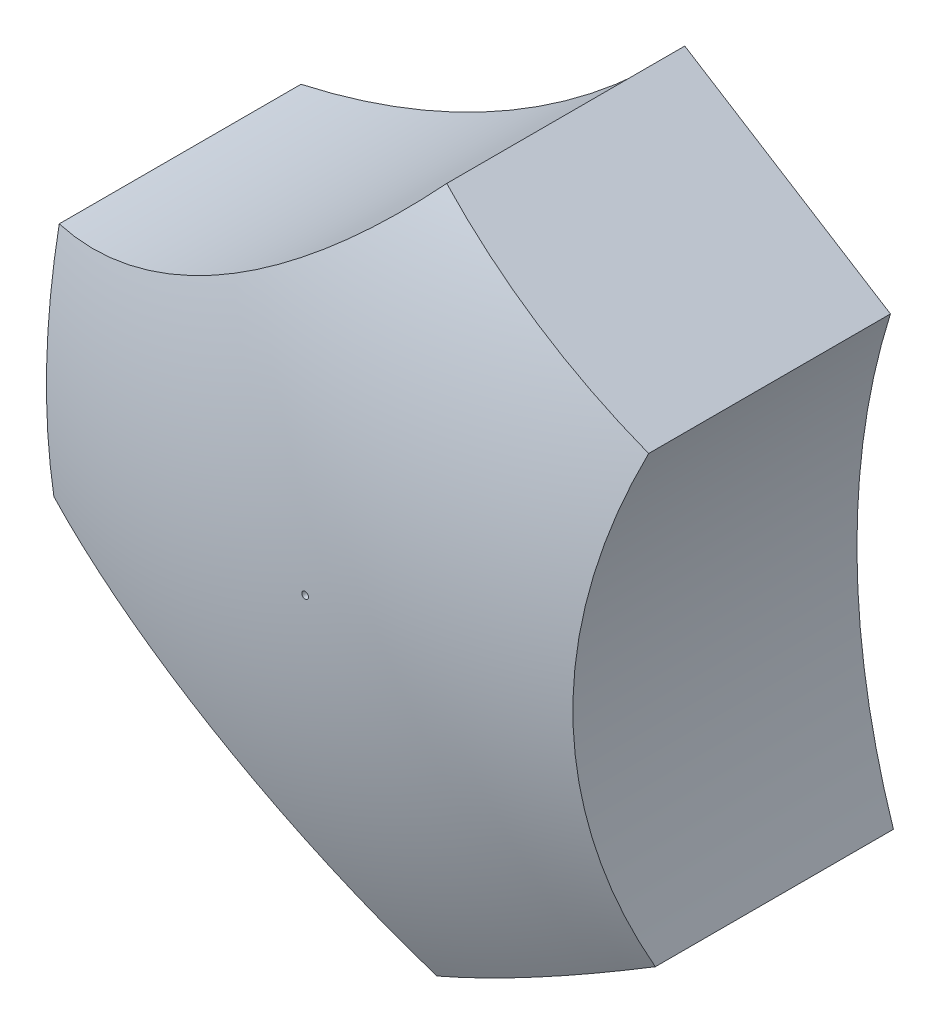
ISO-10303-21;
HEADER;
FILE_DESCRIPTION(('STEP AP214'),'2;1');
FILE_NAME('part.step','',(''),(''),'','','');
FILE_SCHEMA(('AUTOMOTIVE_DESIGN { 1 0 10303 214 1 1 1 1 }'));
ENDSEC;
DATA;
#1=APPLICATION_CONTEXT('core data for automotive mechanical design processes');
#2=APPLICATION_PROTOCOL_DEFINITION('international standard','automotive_design',2000,#1);
#3=PRODUCT_CONTEXT('',#1,'mechanical');
#4=PRODUCT('Part','Part','',(#3));
#5=PRODUCT_RELATED_PRODUCT_CATEGORY('part','',(#4));
#6=PRODUCT_DEFINITION_FORMATION('','',#4);
#7=PRODUCT_DEFINITION_CONTEXT('part definition',#1,'design');
#8=PRODUCT_DEFINITION('design','',#6,#7);
#9=PRODUCT_DEFINITION_SHAPE('','',#8);
#10=(LENGTH_UNIT() NAMED_UNIT(*) SI_UNIT(.MILLI.,.METRE.));
#11=(NAMED_UNIT(*) PLANE_ANGLE_UNIT() SI_UNIT($,.RADIAN.));
#12=(NAMED_UNIT(*) SI_UNIT($,.STERADIAN.) SOLID_ANGLE_UNIT());
#13=UNCERTAINTY_MEASURE_WITH_UNIT(LENGTH_MEASURE(1.E-05),#10,'distance_accuracy_value','');
#14=(GEOMETRIC_REPRESENTATION_CONTEXT(3) GLOBAL_UNCERTAINTY_ASSIGNED_CONTEXT((#13)) GLOBAL_UNIT_ASSIGNED_CONTEXT((#10,
#11,#12)) REPRESENTATION_CONTEXT('',''));
#15=CARTESIAN_POINT('',(0.,0.,0.));
#16=DIRECTION('',(0.,0.,1.));
#17=DIRECTION('',(1.,0.,0.));
#18=AXIS2_PLACEMENT_3D('',#15,#16,#17);
#19=CARTESIAN_POINT('',(0.,0.,24.3));
#20=DIRECTION('',(0.,0.,1.));
#21=DIRECTION('',(1.,0.,0.));
#22=AXIS2_PLACEMENT_3D('',#19,#20,#21);
#23=PLANE('',#22);
#24=CARTESIAN_POINT('',(-63.570571604842,-112.326867462675,24.3));
#25=DIRECTION('',(0.,0.,1.));
#26=DIRECTION('',(1.,0.,0.));
#27=AXIS2_PLACEMENT_3D('',#24,#25,#26);
#28=CIRCLE('',#27,0.25);
#29=CARTESIAN_POINT('',(-63.320571604842,-112.326867462675,24.3));
#30=VERTEX_POINT('',#29);
#31=EDGE_CURVE('E524',#30,#30,#28,.T.);
#32=ORIENTED_EDGE('',*,*,#31,.T.);
#33=EDGE_LOOP('',(#32));
#34=FACE_BOUND('',#33,.T.);
#35=DIRECTION('',(-1.,0.,0.));
#36=VECTOR('',#35,1.);
#37=CARTESIAN_POINT('',(-56.5705716048419,-118.526867462675,24.3));
#38=LINE('',#37,#36);
#39=CARTESIAN_POINT('',(-56.5705716048419,-118.526867462675,24.3));
#40=VERTEX_POINT('',#39);
#41=CARTESIAN_POINT('',(-79.3705716048419,-118.526867462675,24.3));
#42=VERTEX_POINT('',#41);
#43=EDGE_CURVE('E439',#40,#42,#38,.T.);
#44=ORIENTED_EDGE('',*,*,#43,.T.);
#45=DIRECTION('',(0.,1.,0.));
#46=VECTOR('',#45,1.);
#47=CARTESIAN_POINT('',(-79.3705716048419,-106.126867462675,24.3));
#48=LINE('',#47,#46);
#49=CARTESIAN_POINT('',(-79.3705716048419,-106.126867462675,24.3));
#50=VERTEX_POINT('',#49);
#51=EDGE_CURVE('E435',#42,#50,#48,.T.);
#52=ORIENTED_EDGE('',*,*,#51,.T.);
#53=DIRECTION('',(1.,0.,0.));
#54=VECTOR('',#53,1.);
#55=CARTESIAN_POINT('',(-56.5705716048419,-106.126867462675,24.3));
#56=LINE('',#55,#54);
#57=CARTESIAN_POINT('',(-56.5705716048419,-106.126867462675,24.3));
#58=VERTEX_POINT('',#57);
#59=EDGE_CURVE('E438',#50,#58,#56,.T.);
#60=ORIENTED_EDGE('',*,*,#59,.T.);
#61=DIRECTION('',(0.,-1.,0.));
#62=VECTOR('',#61,1.);
#63=CARTESIAN_POINT('',(-56.5705716048419,-106.126867462675,24.3));
#64=LINE('',#63,#62);
#65=EDGE_CURVE('E167',#58,#40,#64,.T.);
#66=ORIENTED_EDGE('',*,*,#65,.T.);
#67=EDGE_LOOP('',(#44,#52,#60,#66));
#68=FACE_BOUND('',#67,.T.);
#69=ADVANCED_FACE('F33',(#34,#68),#23,.F.);
#70=CARTESIAN_POINT('',(8.69567494642423,-112.307669389498,30.001));
#71=DIRECTION('',(0.,0.,-1.));
#72=DIRECTION('',(-1.,0.,0.));
#73=AXIS2_PLACEMENT_3D('',#70,#71,#72);
#74=CYLINDRICAL_SURFACE('',#73,54.6537493119301);
#75=CARTESIAN_POINT('',(8.69567494642423,-112.307669389498,6.));
#76=DIRECTION('',(0.,0.,-1.));
#77=DIRECTION('',(-1.,0.,0.));
#78=AXIS2_PLACEMENT_3D('',#75,#76,#77);
#79=CIRCLE('',#78,54.6537493119301);
#80=CARTESIAN_POINT('',(-43.4312406862717,-95.881562715271,6.));
#81=VERTEX_POINT('',#80);
#82=CARTESIAN_POINT('',(-43.2067127682175,-129.430007529201,6.));
#83=VERTEX_POINT('',#82);
#84=EDGE_CURVE('E456',#81,#83,#79,.F.);
#85=ORIENTED_EDGE('',*,*,#84,.F.);
#86=DIRECTION('',(0.,0.,-1.));
#87=VECTOR('',#86,1.);
#88=CARTESIAN_POINT('',(-43.4312406862717,-95.881562715271,30.001));
#89=LINE('',#88,#87);
#90=CARTESIAN_POINT('',(-43.4312406862717,-95.881562715271,24.2333769111234));
#91=VERTEX_POINT('',#90);
#92=EDGE_CURVE('E181',#91,#81,#89,.T.);
#93=ORIENTED_EDGE('',*,*,#92,.F.);
#94=CARTESIAN_POINT('',(-43.2066467887904,-129.430207529201,23.9530100594632));
#95=CARTESIAN_POINT('',(-43.3528923454607,-128.986927359973,24.1434397979928));
#96=CARTESIAN_POINT('',(-43.4943676268469,-128.538972447002,24.3266776118613));
#97=CARTESIAN_POINT('',(-43.7671840246939,-127.634241002511,24.6784144631344));
#98=CARTESIAN_POINT('',(-43.8985244535061,-127.17746387503,24.8469125005504));
#99=CARTESIAN_POINT('',(-44.150510672908,-126.255481717173,25.1688568373432));
#100=CARTESIAN_POINT('',(-44.2711519291345,-125.790273213177,25.3222967579221));
#101=CARTESIAN_POINT('',(-44.5011063696393,-124.852311888393,25.6136867468969));
#102=CARTESIAN_POINT('',(-44.610419787774,-124.379559223582,25.7516371350696));
#103=CARTESIAN_POINT('',(-44.9202810669618,-122.952281845961,26.1414019673846));
#104=CARTESIAN_POINT('',(-45.1031542094144,-121.987266934314,26.3696442844613));
#105=CARTESIAN_POINT('',(-45.4179037583747,-120.036158616136,26.7607273001604));
#106=CARTESIAN_POINT('',(-45.5497888076715,-119.050068811855,26.9235790830533));
#107=CARTESIAN_POINT('',(-45.7602932343282,-117.059962704586,27.1827330229654));
#108=CARTESIAN_POINT('',(-45.8387257294584,-116.055895975557,27.2788017143797));
#109=CARTESIAN_POINT('',(-45.9399083910563,-114.040669485173,27.4024140625307));
#110=CARTESIAN_POINT('',(-45.9626539453596,-113.029509143259,27.4299520433453));
#111=CARTESIAN_POINT('',(-45.9519687450619,-111.008237143704,27.4161883693437));
#112=CARTESIAN_POINT('',(-45.9185532911831,-109.998125275432,27.3749054643807));
#113=CARTESIAN_POINT('',(-45.7962979264941,-107.986517109054,27.2239935123499));
#114=CARTESIAN_POINT('',(-45.7074649879689,-106.985019743192,27.1143730630903));
#115=CARTESIAN_POINT('',(-45.4895853314221,-105.112263586372,26.8444707643364));
#116=CARTESIAN_POINT('',(-45.3663341731206,-104.239265825915,26.6914599013679));
#117=CARTESIAN_POINT('',(-45.0799285456024,-102.510503786512,26.3341138835261));
#118=CARTESIAN_POINT('',(-44.9167734525055,-101.654739777235,26.1297779262062));
#119=CARTESIAN_POINT('',(-44.5529666998419,-99.9641494942811,25.6711858221884));
#120=CARTESIAN_POINT('',(-44.3522899834653,-99.1293376373937,25.4168963109003));
#121=CARTESIAN_POINT('',(-44.0255540600571,-97.8963789608959,24.9995888475844));
#122=CARTESIAN_POINT('',(-43.9123575317336,-97.4886097068966,24.8545104089575));
#123=CARTESIAN_POINT('',(-43.6777953012632,-96.6798352924432,24.5526346413555));
#124=CARTESIAN_POINT('',(-43.5564299678568,-96.2788298276918,24.3958378413128));
#125=CARTESIAN_POINT('',(-43.4311776623372,-95.881362715271,24.2332951226798));
#126=B_SPLINE_CURVE_WITH_KNOTS('',3,(#94,#95,#96,#97,#98,#99,#100,#101,#102,#103,#104,#105,#106,
#107,#108,#109,#110,#111,#112,#113,#114,#115,#116,#117,#118,#119,#120,#121,#122,#123,#124,#125),
.UNSPECIFIED.,.F.,.F.,(4,2,2,2,2,2,2,2,2,2,2,2,2,2,2,4),(0.,1.51231170013451,3.02472592038071,
4.53777807657546,6.05079899050232,9.07202637587215,12.0927414202224,15.1239641214153,
18.1554378693486,21.1860858447294,24.2163525996147,26.8983305954807,29.5803505255701,
32.2641679378747,33.6060286513345,34.9478288336903),.UNSPECIFIED.);
#127=CARTESIAN_POINT('',(-43.2067127682175,-129.430007529201,23.953095974407));
#128=VERTEX_POINT('',#127);
#129=EDGE_CURVE('E481',#128,#91,#126,.T.);
#130=ORIENTED_EDGE('',*,*,#129,.F.);
#131=DIRECTION('',(0.,0.,-1.));
#132=VECTOR('',#131,1.);
#133=CARTESIAN_POINT('',(-43.2067127682175,-129.430007529201,30.001));
#134=LINE('',#133,#132);
#135=EDGE_CURVE('E172',#128,#83,#134,.T.);
#136=ORIENTED_EDGE('',*,*,#135,.T.);
#137=EDGE_LOOP('',(#85,#93,#130,#136));
#138=FACE_BOUND('',#137,.T.);
#139=ADVANCED_FACE('F35',(#138),#74,.F.);
#140=CARTESIAN_POINT('',(-43.4312406862717,-95.881562715271,30.001));
#141=DIRECTION('',(-0.531899585088479,-0.846807434652474,0.));
#142=DIRECTION('',(0.846807434652474,-0.531899585088479,0.));
#143=AXIS2_PLACEMENT_3D('',#140,#141,#142);
#144=PLANE('',#143);
#145=DIRECTION('',(0.846807434652474,-0.531899585088479,0.));
#146=VECTOR('',#145,1.);
#147=CARTESIAN_POINT('',(-43.4312406862717,-95.881562715271,6.));
#148=LINE('',#147,#146);
#149=CARTESIAN_POINT('',(-58.9407472410591,-86.1396783578149,6.));
#150=VERTEX_POINT('',#149);
#151=EDGE_CURVE('E442',#150,#81,#148,.T.);
#152=ORIENTED_EDGE('',*,*,#151,.F.);
#153=DIRECTION('',(0.,0.,-1.));
#154=VECTOR('',#153,1.);
#155=CARTESIAN_POINT('',(-58.9407472410591,-86.1396783578149,30.001));
#156=LINE('',#155,#154);
#157=CARTESIAN_POINT('',(-58.940747241059,-86.1396783578149,23.9530959744076));
#158=VERTEX_POINT('',#157);
#159=EDGE_CURVE('E475',#158,#150,#156,.T.);
#160=ORIENTED_EDGE('',*,*,#159,.F.);
#161=CARTESIAN_POINT('',(-50.4655721371861,-91.4631343607164,-31.5));
#162=DIRECTION('',(-0.531899585088479,-0.846807434652474,0.));
#163=DIRECTION('',(0.846807434652474,-0.531899585088479,0.));
#164=AXIS2_PLACEMENT_3D('',#161,#162,#163);
#165=CIRCLE('',#164,56.3490339757746);
#166=EDGE_CURVE('E205',#91,#158,#165,.T.);
#167=ORIENTED_EDGE('',*,*,#166,.F.);
#168=ORIENTED_EDGE('',*,*,#92,.T.);
#169=EDGE_LOOP('',(#152,#160,#167,#168));
#170=FACE_BOUND('',#169,.T.);
#171=ADVANCED_FACE('F210',(#170),#144,.F.);
#172=CARTESIAN_POINT('',(-99.720320899549,-49.7520611497166,30.001));
#173=DIRECTION('',(0.,0.,-1.));
#174=DIRECTION('',(-1.,0.,0.));
#175=AXIS2_PLACEMENT_3D('',#172,#173,#174);
#176=CYLINDRICAL_SURFACE('',#175,54.6537493119301);
#177=CARTESIAN_POINT('',(-99.720320899549,-49.7520611497166,6.));
#178=DIRECTION('',(0.,0.,-1.));
#179=DIRECTION('',(-1.,0.,0.));
#180=AXIS2_PLACEMENT_3D('',#177,#178,#179);
#181=CIRCLE('',#180,54.6537493119301);
#182=CARTESIAN_POINT('',(-87.8822887483556,-103.108347645673,6.));
#183=VERTEX_POINT('',#182);
#184=EDGE_CURVE('E462',#183,#150,#181,.F.);
#185=ORIENTED_EDGE('',*,*,#184,.F.);
#186=DIRECTION('',(0.,0.,-1.));
#187=VECTOR('',#186,1.);
#188=CARTESIAN_POINT('',(-87.8822887483556,-103.108347645673,30.001));
#189=LINE('',#188,#187);
#190=CARTESIAN_POINT('',(-87.8822887483556,-103.108347645673,24.2333769111237));
#191=VERTEX_POINT('',#190);
#192=EDGE_CURVE('E477',#191,#183,#189,.T.);
#193=ORIENTED_EDGE('',*,*,#192,.F.);
#194=CARTESIAN_POINT('',(-58.9405687819222,-86.1394783578149,23.9529866258838));
#195=CARTESIAN_POINT('',(-59.2513374075776,-86.4877710046029,24.143416980077));
#196=CARTESIAN_POINT('',(-59.5685396216396,-86.8342698596041,24.3266554155866));
#197=CARTESIAN_POINT('',(-60.2156508884665,-87.5229019663791,24.6783935213952));
#198=CARTESIAN_POINT('',(-60.5455608011765,-87.8650349206141,24.846892191704));
#199=CARTESIAN_POINT('',(-61.2180267372286,-88.5442529844678,25.1688378052671));
#200=CARTESIAN_POINT('',(-61.5605880360249,-88.881335904026,25.3222783696988));
#201=CARTESIAN_POINT('',(-62.2579082554398,-89.5494635345248,25.6136696556693));
#202=CARTESIAN_POINT('',(-62.6126669240492,-89.8805083700018,25.7516206969853));
#203=CARTESIAN_POINT('',(-63.6937934692278,-90.8624957681063,26.1413875020715));
#204=CARTESIAN_POINT('',(-64.4380835116917,-91.5033767200863,26.369631150617));
#205=CARTESIAN_POINT('',(-65.9704165724393,-92.7515135143204,26.7607168494212));
#206=CARTESIAN_POINT('',(-66.7584521496573,-93.358775040315,26.9235699839671));
#207=CARTESIAN_POINT('',(-68.3766810674309,-94.536132026671,27.1827266413581));
#208=CARTESIAN_POINT('',(-69.2070115203114,-95.1060908550611,27.27879669764));
#209=CARTESIAN_POINT('',(-70.9016564680414,-96.2013327964234,27.4024117665473));
#210=CARTESIAN_POINT('',(-71.7659737717482,-96.7266122054507,27.4299511032808));
#211=CARTESIAN_POINT('',(-73.5217884886974,-97.727996628458,27.416190116548));
#212=CARTESIAN_POINT('',(-74.4132784339295,-98.2041149985925,27.3749085429981));
#213=CARTESIAN_POINT('',(-76.2165093987883,-99.1040450013332,27.2239992152452));
#214=CARTESIAN_POINT('',(-77.1282478570004,-99.5278632058814,27.1143800587138));
#215=CARTESIAN_POINT('',(-78.8590457714747,-100.275555724685,26.8444795451188));
#216=CARTESIAN_POINT('',(-79.6767134710498,-100.605318422108,26.6914689305401));
#217=CARTESIAN_POINT('',(-81.3170760308314,-101.221669375926,26.3341228795743));
#218=CARTESIAN_POINT('',(-82.1397709694649,-101.508256956974,26.1297866404806));
#219=CARTESIAN_POINT('',(-83.7857766280038,-102.038489858825,25.6711934485094));
#220=CARTESIAN_POINT('',(-84.609087391051,-102.282106268659,25.4169031278673));
#221=CARTESIAN_POINT('',(-85.8402350652038,-102.615626096203,24.9995940839415));
#222=CARTESIAN_POINT('',(-86.2499739172598,-102.721480299553,24.8545150577432));
#223=CARTESIAN_POINT('',(-87.0676783185282,-102.922731841944,24.5526379962519));
#224=CARTESIAN_POINT('',(-87.4756439469014,-103.018129652485,24.395840489905));
#225=CARTESIAN_POINT('',(-87.8824887483556,-103.108392018803,24.2332970072443));
#226=B_SPLINE_CURVE_WITH_KNOTS('',3,(#194,#195,#196,#197,#198,#199,#200,#201,#202,#203,#204,
#205,#206,#207,#208,#209,#210,#211,#212,#213,#214,#215,#216,#217,#218,#219,#220,#221,#222,#223,
#224,#225),.UNSPECIFIED.,.F.,.F.,(4,2,2,2,2,2,2,2,2,2,2,2,2,2,2,4),(0.,1.51231190767944,
3.02472633573341,4.5377787027405,6.05079982742387,9.07202766677665,12.0927431641034,
15.1239663640974,18.1554406095009,21.1860890797122,24.2163563356277,26.8983475153942,
29.5803806427472,32.2642114136758,33.6060787999319,34.9478856538136),.UNSPECIFIED.);
#227=EDGE_CURVE('E199',#158,#191,#226,.T.);
#228=ORIENTED_EDGE('',*,*,#227,.F.);
#229=ORIENTED_EDGE('',*,*,#159,.T.);
#230=EDGE_LOOP('',(#185,#193,#228,#229));
#231=FACE_BOUND('',#230,.T.);
#232=ADVANCED_FACE('F206',(#231),#176,.F.);
#233=CARTESIAN_POINT('',(-87.8822887483556,-103.108347645673,30.001));
#234=DIRECTION('',(0.999306543066813,-0.0372348356227872,0.));
#235=DIRECTION('',(0.0372348356227872,0.999306543066813,0.));
#236=AXIS2_PLACEMENT_3D('',#233,#234,#235);
#237=PLANE('',#236);
#238=DIRECTION('',(0.0372348356227865,0.999306543066813,0.));
#239=VECTOR('',#238,1.);
#240=CARTESIAN_POINT('',(-88.1236333118872,-109.585540237956,12.7524023381227));
#241=LINE('',#240,#239);
#242=CARTESIAN_POINT('',(-88.2853940916186,-113.926867462675,12.7524023381227));
#243=VERTEX_POINT('',#242);
#244=CARTESIAN_POINT('',(-88.1661599338723,-110.726867462675,12.7524023381227));
#245=VERTEX_POINT('',#244);
#246=EDGE_CURVE('E140',#243,#245,#241,.T.);
#247=ORIENTED_EDGE('',*,*,#246,.T.);
#248=DIRECTION('',(0.,0.,1.));
#249=VECTOR('',#248,1.);
#250=CARTESIAN_POINT('',(-88.1661599338723,-110.726867462675,30.001));
#251=LINE('',#250,#249);
#252=CARTESIAN_POINT('',(-88.1661599338723,-110.726867462675,20.3205645179467));
#253=VERTEX_POINT('',#252);
#254=EDGE_CURVE('E148',#245,#253,#251,.T.);
#255=ORIENTED_EDGE('',*,*,#254,.T.);
#256=DIRECTION('',(-0.0372348356227871,-0.999306543066813,0.));
#257=VECTOR('',#256,1.);
#258=CARTESIAN_POINT('',(-88.3179954737461,-114.801821626649,20.3205645179467));
#259=LINE('',#258,#257);
#260=CARTESIAN_POINT('',(-88.2853940916186,-113.926867462675,20.3205645179467));
#261=VERTEX_POINT('',#260);
#262=EDGE_CURVE('E149',#253,#261,#259,.T.);
#263=ORIENTED_EDGE('',*,*,#262,.T.);
#264=DIRECTION('',(0.,0.,-1.));
#265=VECTOR('',#264,1.);
#266=CARTESIAN_POINT('',(-88.2853940916186,-113.926867462675,30.001));
#267=LINE('',#266,#265);
#268=EDGE_CURVE('E168',#261,#243,#267,.T.);
#269=ORIENTED_EDGE('',*,*,#268,.T.);
#270=EDGE_LOOP('',(#247,#255,#263,#269));
#271=FACE_BOUND('',#270,.T.);
#272=ORIENTED_EDGE('',*,*,#192,.T.);
#273=DIRECTION('',(0.0372348356227872,0.999306543066813,0.));
#274=VECTOR('',#273,1.);
#275=CARTESIAN_POINT('',(-87.8822887483556,-103.108347645673,6.));
#276=LINE('',#275,#274);
#277=CARTESIAN_POINT('',(-88.5642548052491,-121.410916501009,6.));
#278=VERTEX_POINT('',#277);
#279=EDGE_CURVE('E430',#278,#183,#276,.T.);
#280=ORIENTED_EDGE('',*,*,#279,.F.);
#281=DIRECTION('',(0.,0.,-1.));
#282=VECTOR('',#281,1.);
#283=CARTESIAN_POINT('',(-88.5642548052491,-121.410916501009,30.001));
#284=LINE('',#283,#282);
#285=CARTESIAN_POINT('',(-88.5642548052491,-121.410916501009,23.9530959744074));
#286=VERTEX_POINT('',#285);
#287=EDGE_CURVE('E492',#286,#278,#284,.T.);
#288=ORIENTED_EDGE('',*,*,#287,.F.);
#289=CARTESIAN_POINT('',(-88.1915942227441,-111.409471558081,-31.5));
#290=DIRECTION('',(0.999306543066813,-0.0372348356227872,0.));
#291=DIRECTION('',(0.0372348356227872,0.999306543066813,0.));
#292=AXIS2_PLACEMENT_3D('',#289,#290,#291);
#293=CIRCLE('',#292,56.3490339757747);
#294=EDGE_CURVE('E180',#191,#286,#293,.T.);
#295=ORIENTED_EDGE('',*,*,#294,.F.);
#296=EDGE_LOOP('',(#272,#280,#288,#295));
#297=FACE_BOUND('',#296,.T.);
#298=ADVANCED_FACE('F209',(#271,#297),#237,.F.);
#299=CARTESIAN_POINT('',(-99.6870688614008,-174.920871848809,30.001));
#300=DIRECTION('',(0.,0.,-1.));
#301=DIRECTION('',(-1.,0.,0.));
#302=AXIS2_PLACEMENT_3D('',#299,#300,#301);
#303=CYLINDRICAL_SURFACE('',#302,54.6537493119301);
#304=CARTESIAN_POINT('',(-99.6870688614008,-174.920871848809,6.));
#305=DIRECTION('',(0.,0.,-1.));
#306=DIRECTION('',(-1.,0.,0.));
#307=AXIS2_PLACEMENT_3D('',#304,#305,#306);
#308=CIRCLE('',#307,54.6537493119301);
#309=CARTESIAN_POINT('',(-59.3981853798986,-137.99069202708,6.));
#310=VERTEX_POINT('',#309);
#311=EDGE_CURVE('E454',#310,#278,#308,.F.);
#312=ORIENTED_EDGE('',*,*,#311,.F.);
#313=DIRECTION('',(0.,0.,-1.));
#314=VECTOR('',#313,1.);
#315=CARTESIAN_POINT('',(-59.3981853798986,-137.99069202708,30.001));
#316=LINE('',#315,#314);
#317=CARTESIAN_POINT('',(-59.3981853798986,-137.99069202708,24.233376911123));
#318=VERTEX_POINT('',#317);
#319=EDGE_CURVE('E489',#318,#310,#316,.T.);
#320=ORIENTED_EDGE('',*,*,#319,.F.);
#321=CARTESIAN_POINT('',(-88.5644548052491,-121.410874928521,23.953012640657));
#322=CARTESIAN_POINT('',(-88.1074400842228,-121.505862712518,24.1434423310017));
#323=CARTESIAN_POINT('',(-87.6487620553901,-121.607319049806,24.3266800945432));
#324=CARTESIAN_POINT('',(-86.7288333375719,-121.823418981423,24.6784168408493));
#325=CARTESIAN_POINT('',(-86.2675824762927,-121.938063469255,24.8469148236248));
#326=CARTESIAN_POINT('',(-85.3431292984913,-122.180828228051,25.1688590467262));
#327=CARTESIAN_POINT('',(-84.8799262409095,-122.308954162694,25.322298908257));
#328=CARTESIAN_POINT('',(-83.9526505956509,-122.5787885915,25.6136887748154));
#329=CARTESIAN_POINT('',(-83.4885780261261,-122.720496805147,25.7516390996201));
#330=CARTESIAN_POINT('',(-82.0975888200695,-123.165787985957,26.1414037290268));
#331=CARTESIAN_POINT('',(-81.1704247705012,-123.489922810655,26.3696459017204));
#332=CARTESIAN_POINT('',(-79.3233405463354,-124.192896181892,26.760728615549));
#333=CARTESIAN_POINT('',(-78.4034191699825,-124.571725442438,26.9235802409464));
#334=CARTESIAN_POINT('',(-76.5746844685165,-125.38447664179,27.182733853624));
#335=CARTESIAN_POINT('',(-75.6659209143887,-125.818585638501,27.2788023751112));
#336=CARTESIAN_POINT('',(-73.8700922465619,-126.738572458047,27.4024143726993));
#337=CARTESIAN_POINT('',(-72.9830289361553,-127.224454565385,27.4299521729149));
#338=CARTESIAN_POINT('',(-71.2378986637956,-128.244344552729,27.416188128928));
#339=CARTESIAN_POINT('',(-70.3798238695458,-128.778339288049,27.3749050334257));
#340=CARTESIAN_POINT('',(-68.6988478332092,-129.890019955157,27.223992691651));
#341=CARTESIAN_POINT('',(-67.8759421803586,-130.467700382755,27.1143720430206));
#342=CARTESIAN_POINT('',(-66.3630239585494,-131.592770855615,26.8444686951638));
#343=CARTESIAN_POINT('',(-65.6686077833951,-132.136011442049,26.6914567070715));
#344=CARTESIAN_POINT('',(-64.3146521156812,-133.248433398325,26.3341079018887));
#345=CARTESIAN_POINT('',(-63.6551131688069,-133.81761517378,26.1297702820504));
#346=CARTESIAN_POINT('',(-62.3729165762968,-134.977983025601,25.6711743363458));
#347=CARTESIAN_POINT('',(-61.7502839457984,-135.569183594179,25.4168826440299));
#348=CARTESIAN_POINT('',(-60.8458746431731,-136.468629868791,24.9995715533947));
#349=CARTESIAN_POINT('',(-60.5493331894581,-136.770547350573,24.854491846954));
#350=CARTESIAN_POINT('',(-59.9661928586791,-137.378074994105,24.5526134293063));
#351=CARTESIAN_POINT('',(-59.6795935337017,-137.683684988662,24.3958152470472));
#352=CARTESIAN_POINT('',(-59.3980020539158,-137.99089202708,24.2332710909763));
#353=B_SPLINE_CURVE_WITH_KNOTS('',3,(#321,#322,#323,#324,#325,#326,#327,#328,#329,#330,#331,
#332,#333,#334,#335,#336,#337,#338,#339,#340,#341,#342,#343,#344,#345,#346,#347,#348,#349,#350,
#351,#352),.UNSPECIFIED.,.F.,.F.,(4,2,2,2,2,2,2,2,2,2,2,2,2,2,2,4),(0.,1.51231183314212,
3.02472618641525,4.5377784752382,6.05079952177855,9.07202709570771,12.0927423290604,
15.1239652264962,18.1554391690196,21.1860873898186,24.2163543975078,26.8983467088561,
29.5803809699564,32.264212804658,33.6060807197891,34.9478881022868),.UNSPECIFIED.);
#354=EDGE_CURVE('E173',#286,#318,#353,.T.);
#355=ORIENTED_EDGE('',*,*,#354,.F.);
#356=ORIENTED_EDGE('',*,*,#287,.T.);
#357=EDGE_LOOP('',(#312,#320,#355,#356));
#358=FACE_BOUND('',#357,.T.);
#359=ADVANCED_FACE('F183',(#358),#303,.F.);
#360=CARTESIAN_POINT('',(-59.3981853798986,-137.99069202708,30.001));
#361=DIRECTION('',(-0.467406957978335,0.884042270275261,0.));
#362=DIRECTION('',(-0.884042270275261,-0.467406957978335,0.));
#363=AXIS2_PLACEMENT_3D('',#360,#361,#362);
#364=PLANE('',#363);
#365=DIRECTION('',(-0.884042270275261,-0.467406957978335,0.));
#366=VECTOR('',#365,1.);
#367=CARTESIAN_POINT('',(-59.3981853798986,-137.99069202708,6.));
#368=LINE('',#367,#366);
#369=EDGE_CURVE('E453',#83,#310,#368,.T.);
#370=ORIENTED_EDGE('',*,*,#369,.F.);
#371=ORIENTED_EDGE('',*,*,#135,.F.);
#372=CARTESIAN_POINT('',(-52.0545484545963,-134.107996469226,-31.5));
#373=DIRECTION('',(-0.467406957978335,0.884042270275261,0.));
#374=DIRECTION('',(-0.884042270275261,-0.467406957978335,0.));
#375=AXIS2_PLACEMENT_3D('',#372,#373,#374);
#376=CIRCLE('',#375,56.3490339757741);
#377=EDGE_CURVE('E43',#318,#128,#376,.T.);
#378=ORIENTED_EDGE('',*,*,#377,.F.);
#379=ORIENTED_EDGE('',*,*,#319,.T.);
#380=EDGE_LOOP('',(#370,#371,#378,#379));
#381=FACE_BOUND('',#380,.T.);
#382=ADVANCED_FACE('F195',(#381),#364,.F.);
#383=CARTESIAN_POINT('',(-79.3705716048419,-110.726867462675,24.3));
#384=DIRECTION('',(0.,1.,0.));
#385=DIRECTION('',(0.,0.,1.));
#386=AXIS2_PLACEMENT_3D('',#383,#384,#385);
#387=PLANE('',#386);
#388=ORIENTED_EDGE('',*,*,#254,.F.);
#389=DIRECTION('',(1.,0.,0.));
#390=VECTOR('',#389,1.);
#391=CARTESIAN_POINT('',(-79.3705716048419,-110.726867462675,12.7524023381227));
#392=LINE('',#391,#390);
#393=CARTESIAN_POINT('',(-79.3705716048419,-110.726867462675,12.7524023381227));
#394=VERTEX_POINT('',#393);
#395=EDGE_CURVE('E136',#245,#394,#392,.T.);
#396=ORIENTED_EDGE('',*,*,#395,.T.);
#397=DIRECTION('',(0.,0.,-1.));
#398=VECTOR('',#397,1.);
#399=CARTESIAN_POINT('',(-79.3705716048419,-110.726867462675,24.3));
#400=LINE('',#399,#398);
#401=CARTESIAN_POINT('',(-79.3705716048419,-110.726867462675,20.3205645179467));
#402=VERTEX_POINT('',#401);
#403=EDGE_CURVE('E146',#402,#394,#400,.T.);
#404=ORIENTED_EDGE('',*,*,#403,.F.);
#405=DIRECTION('',(-1.,0.,0.));
#406=VECTOR('',#405,1.);
#407=CARTESIAN_POINT('',(-79.3705716048419,-110.726867462675,20.3205645179467));
#408=LINE('',#407,#406);
#409=EDGE_CURVE('E431',#402,#253,#408,.T.);
#410=ORIENTED_EDGE('',*,*,#409,.T.);
#411=EDGE_LOOP('',(#388,#396,#404,#410));
#412=FACE_BOUND('',#411,.T.);
#413=ADVANCED_FACE('F144',(#412),#387,.F.);
#414=CARTESIAN_POINT('',(-79.3705716048419,-113.926867462675,24.3));
#415=DIRECTION('',(0.,-1.,0.));
#416=DIRECTION('',(0.,0.,-1.));
#417=AXIS2_PLACEMENT_3D('',#414,#415,#416);
#418=PLANE('',#417);
#419=DIRECTION('',(0.,0.,-1.));
#420=VECTOR('',#419,1.);
#421=CARTESIAN_POINT('',(-79.3705716048419,-113.926867462675,24.3));
#422=LINE('',#421,#420);
#423=CARTESIAN_POINT('',(-79.3705716048419,-113.926867462675,20.3205645179467));
#424=VERTEX_POINT('',#423);
#425=CARTESIAN_POINT('',(-79.3705716048419,-113.926867462675,12.7524023381227));
#426=VERTEX_POINT('',#425);
#427=EDGE_CURVE('E55',#424,#426,#422,.T.);
#428=ORIENTED_EDGE('',*,*,#427,.T.);
#429=DIRECTION('',(-1.,0.,0.));
#430=VECTOR('',#429,1.);
#431=CARTESIAN_POINT('',(-79.3705716048419,-113.926867462675,12.7524023381227));
#432=LINE('',#431,#430);
#433=EDGE_CURVE('E50',#426,#243,#432,.T.);
#434=ORIENTED_EDGE('',*,*,#433,.T.);
#435=ORIENTED_EDGE('',*,*,#268,.F.);
#436=DIRECTION('',(1.,0.,0.));
#437=VECTOR('',#436,1.);
#438=CARTESIAN_POINT('',(-79.3705716048419,-113.926867462675,20.3205645179467));
#439=LINE('',#438,#437);
#440=EDGE_CURVE('E507',#261,#424,#439,.T.);
#441=ORIENTED_EDGE('',*,*,#440,.T.);
#442=EDGE_LOOP('',(#428,#434,#435,#441));
#443=FACE_BOUND('',#442,.T.);
#444=ADVANCED_FACE('F240',(#443),#418,.F.);
#445=CARTESIAN_POINT('',(-56.5705716048419,-118.526867462675,24.3));
#446=DIRECTION('',(0.,-1.,0.));
#447=DIRECTION('',(0.,0.,-1.));
#448=AXIS2_PLACEMENT_3D('',#445,#446,#447);
#449=PLANE('',#448);
#450=DIRECTION('',(1.,0.,0.));
#451=VECTOR('',#450,1.);
#452=CARTESIAN_POINT('',(-56.5705716048419,-118.526867462675,6.));
#453=LINE('',#452,#451);
#454=CARTESIAN_POINT('',(-79.3705716048419,-118.526867462675,6.));
#455=VERTEX_POINT('',#454);
#456=CARTESIAN_POINT('',(-56.5705716048419,-118.526867462675,6.));
#457=VERTEX_POINT('',#456);
#458=EDGE_CURVE('E425',#455,#457,#453,.T.);
#459=ORIENTED_EDGE('',*,*,#458,.F.);
#460=DIRECTION('',(0.,0.,-1.));
#461=VECTOR('',#460,1.);
#462=CARTESIAN_POINT('',(-79.3705716048419,-118.526867462675,24.3));
#463=LINE('',#462,#461);
#464=EDGE_CURVE('E161',#42,#455,#463,.T.);
#465=ORIENTED_EDGE('',*,*,#464,.F.);
#466=ORIENTED_EDGE('',*,*,#43,.F.);
#467=DIRECTION('',(0.,0.,-1.));
#468=VECTOR('',#467,1.);
#469=CARTESIAN_POINT('',(-56.5705716048419,-118.526867462675,24.3));
#470=LINE('',#469,#468);
#471=EDGE_CURVE('E170',#40,#457,#470,.T.);
#472=ORIENTED_EDGE('',*,*,#471,.T.);
#473=EDGE_LOOP('',(#459,#465,#466,#472));
#474=FACE_BOUND('',#473,.T.);
#475=ADVANCED_FACE('F193',(#474),#449,.F.);
#476=CARTESIAN_POINT('',(-56.5705716048419,-106.126867462675,24.3));
#477=DIRECTION('',(1.,0.,0.));
#478=DIRECTION('',(0.,0.,-1.));
#479=AXIS2_PLACEMENT_3D('',#476,#477,#478);
#480=PLANE('',#479);
#481=DIRECTION('',(0.,1.,0.));
#482=VECTOR('',#481,1.);
#483=CARTESIAN_POINT('',(-56.5705716048419,-106.126867462675,6.));
#484=LINE('',#483,#482);
#485=CARTESIAN_POINT('',(-56.5705716048419,-106.126867462675,6.));
#486=VERTEX_POINT('',#485);
#487=EDGE_CURVE('E450',#457,#486,#484,.T.);
#488=ORIENTED_EDGE('',*,*,#487,.F.);
#489=ORIENTED_EDGE('',*,*,#471,.F.);
#490=ORIENTED_EDGE('',*,*,#65,.F.);
#491=DIRECTION('',(0.,0.,-1.));
#492=VECTOR('',#491,1.);
#493=CARTESIAN_POINT('',(-56.5705716048419,-106.126867462675,24.3));
#494=LINE('',#493,#492);
#495=EDGE_CURVE('E159',#58,#486,#494,.T.);
#496=ORIENTED_EDGE('',*,*,#495,.T.);
#497=EDGE_LOOP('',(#488,#489,#490,#496));
#498=FACE_BOUND('',#497,.T.);
#499=ADVANCED_FACE('F230',(#498),#480,.F.);
#500=CARTESIAN_POINT('',(-56.5705716048419,-106.126867462675,24.3));
#501=DIRECTION('',(0.,1.,0.));
#502=DIRECTION('',(0.,0.,1.));
#503=AXIS2_PLACEMENT_3D('',#500,#501,#502);
#504=PLANE('',#503);
#505=DIRECTION('',(-1.,0.,0.));
#506=VECTOR('',#505,1.);
#507=CARTESIAN_POINT('',(-56.5705716048419,-106.126867462675,6.));
#508=LINE('',#507,#506);
#509=CARTESIAN_POINT('',(-79.3705716048419,-106.126867462675,6.));
#510=VERTEX_POINT('',#509);
#511=EDGE_CURVE('E452',#486,#510,#508,.T.);
#512=ORIENTED_EDGE('',*,*,#511,.F.);
#513=ORIENTED_EDGE('',*,*,#495,.F.);
#514=ORIENTED_EDGE('',*,*,#59,.F.);
#515=DIRECTION('',(0.,0.,-1.));
#516=VECTOR('',#515,1.);
#517=CARTESIAN_POINT('',(-79.3705716048419,-106.126867462675,24.3));
#518=LINE('',#517,#516);
#519=EDGE_CURVE('E156',#50,#510,#518,.T.);
#520=ORIENTED_EDGE('',*,*,#519,.T.);
#521=EDGE_LOOP('',(#512,#513,#514,#520));
#522=FACE_BOUND('',#521,.T.);
#523=ADVANCED_FACE('F233',(#522),#504,.F.);
#524=CARTESIAN_POINT('',(-79.3705716048419,-113.926867462675,24.3));
#525=DIRECTION('',(-1.,0.,0.));
#526=DIRECTION('',(0.,0.,1.));
#527=AXIS2_PLACEMENT_3D('',#524,#525,#526);
#528=PLANE('',#527);
#529=ORIENTED_EDGE('',*,*,#403,.T.);
#530=DIRECTION('',(0.,-1.,0.));
#531=VECTOR('',#530,1.);
#532=CARTESIAN_POINT('',(-79.3705716048419,-110.236197509695,12.7524023381227));
#533=LINE('',#532,#531);
#534=EDGE_CURVE('E132',#394,#426,#533,.T.);
#535=ORIENTED_EDGE('',*,*,#534,.T.);
#536=ORIENTED_EDGE('',*,*,#427,.F.);
#537=DIRECTION('',(0.,1.,0.));
#538=VECTOR('',#537,1.);
#539=CARTESIAN_POINT('',(-79.3705716048419,-115.452478898389,20.3205645179467));
#540=LINE('',#539,#538);
#541=EDGE_CURVE('E155',#424,#402,#540,.T.);
#542=ORIENTED_EDGE('',*,*,#541,.T.);
#543=EDGE_LOOP('',(#529,#535,#536,#542));
#544=FACE_BOUND('',#543,.T.);
#545=DIRECTION('',(0.,-1.,0.));
#546=VECTOR('',#545,1.);
#547=CARTESIAN_POINT('',(-79.3705716048419,-113.926867462675,6.));
#548=LINE('',#547,#546);
#549=EDGE_CURVE('E11',#510,#455,#548,.T.);
#550=ORIENTED_EDGE('',*,*,#549,.F.);
#551=ORIENTED_EDGE('',*,*,#519,.F.);
#552=ORIENTED_EDGE('',*,*,#51,.F.);
#553=ORIENTED_EDGE('',*,*,#464,.T.);
#554=EDGE_LOOP('',(#550,#551,#552,#553));
#555=FACE_BOUND('',#554,.T.);
#556=ADVANCED_FACE('F152',(#544,#555),#528,.F.);
#557=CARTESIAN_POINT('',(-63.5705716048424,-112.326867462674,-31.5));
#558=DIRECTION('',(0.,1.,0.));
#559=DIRECTION('',(1.,0.,0.));
#560=AXIS2_PLACEMENT_3D('',#557,#558,#559);
#561=SPHERICAL_SURFACE('',#560,61.5);
#562=CARTESIAN_POINT('',(-63.570571604842,-112.326867462675,29.9994918678195));
#563=DIRECTION('',(0.,0.,-1.));
#564=DIRECTION('',(0.,1.,0.));
#565=AXIS2_PLACEMENT_3D('',#562,#563,#564);
#566=CIRCLE('',#565,0.25);
#567=CARTESIAN_POINT('',(-63.570571604842,-112.076867462675,29.9994918678195));
#568=VERTEX_POINT('',#567);
#569=EDGE_CURVE('E38',#568,#568,#566,.F.);
#570=ORIENTED_EDGE('',*,*,#569,.F.);
#571=EDGE_LOOP('',(#570));
#572=FACE_BOUND('',#571,.T.);
#573=ORIENTED_EDGE('',*,*,#129,.T.);
#574=ORIENTED_EDGE('',*,*,#166,.T.);
#575=ORIENTED_EDGE('',*,*,#227,.T.);
#576=ORIENTED_EDGE('',*,*,#294,.T.);
#577=ORIENTED_EDGE('',*,*,#354,.T.);
#578=ORIENTED_EDGE('',*,*,#377,.T.);
#579=EDGE_LOOP('',(#573,#574,#575,#576,#577,#578));
#580=FACE_BOUND('',#579,.T.);
#581=ADVANCED_FACE('F187',(#572,#580),#561,.T.);
#582=CARTESIAN_POINT('',(-58.0609070345445,-105.419498893883,6.));
#583=DIRECTION('',(0.,0.,-1.));
#584=DIRECTION('',(-1.,0.,0.));
#585=AXIS2_PLACEMENT_3D('',#582,#583,#584);
#586=PLANE('',#585);
#587=CARTESIAN_POINT('',(-81.3705716048419,-112.326867462675,6.));
#588=DIRECTION('',(0.,0.,-1.));
#589=DIRECTION('',(-1.,0.,0.));
#590=AXIS2_PLACEMENT_3D('',#587,#588,#589);
#591=CIRCLE('',#590,0.999999999999998);
#592=CARTESIAN_POINT('',(-82.3705716048419,-112.326867462675,6.));
#593=VERTEX_POINT('',#592);
#594=EDGE_CURVE('E521',#593,#593,#591,.T.);
#595=ORIENTED_EDGE('',*,*,#594,.F.);
#596=EDGE_LOOP('',(#595));
#597=FACE_BOUND('',#596,.T.);
#598=CARTESIAN_POINT('',(-54.5705716048419,-112.326867462675,6.));
#599=DIRECTION('',(0.,0.,-1.));
#600=DIRECTION('',(-1.,0.,0.));
#601=AXIS2_PLACEMENT_3D('',#598,#599,#600);
#602=CIRCLE('',#601,0.999999999999998);
#603=CARTESIAN_POINT('',(-55.5705716048419,-112.326867462675,6.));
#604=VERTEX_POINT('',#603);
#605=EDGE_CURVE('E515',#604,#604,#602,.T.);
#606=ORIENTED_EDGE('',*,*,#605,.F.);
#607=EDGE_LOOP('',(#606));
#608=FACE_BOUND('',#607,.T.);
#609=ORIENTED_EDGE('',*,*,#279,.T.);
#610=ORIENTED_EDGE('',*,*,#184,.T.);
#611=ORIENTED_EDGE('',*,*,#151,.T.);
#612=ORIENTED_EDGE('',*,*,#84,.T.);
#613=ORIENTED_EDGE('',*,*,#369,.T.);
#614=ORIENTED_EDGE('',*,*,#311,.T.);
#615=EDGE_LOOP('',(#609,#610,#611,#612,#613,#614));
#616=FACE_BOUND('',#615,.T.);
#617=ORIENTED_EDGE('',*,*,#511,.T.);
#618=ORIENTED_EDGE('',*,*,#549,.T.);
#619=ORIENTED_EDGE('',*,*,#458,.T.);
#620=ORIENTED_EDGE('',*,*,#487,.T.);
#621=EDGE_LOOP('',(#617,#618,#619,#620));
#622=FACE_BOUND('',#621,.T.);
#623=ADVANCED_FACE('F191',(#597,#608,#616,#622),#586,.T.);
#624=CARTESIAN_POINT('',(-70.8556901333865,-115.452478898389,20.3205645179467));
#625=DIRECTION('',(0.,0.,-1.));
#626=DIRECTION('',(-1.,0.,0.));
#627=AXIS2_PLACEMENT_3D('',#624,#625,#626);
#628=PLANE('',#627);
#629=ORIENTED_EDGE('',*,*,#409,.F.);
#630=ORIENTED_EDGE('',*,*,#541,.F.);
#631=ORIENTED_EDGE('',*,*,#440,.F.);
#632=ORIENTED_EDGE('',*,*,#262,.F.);
#633=EDGE_LOOP('',(#629,#630,#631,#632));
#634=FACE_BOUND('',#633,.T.);
#635=ADVANCED_FACE('F255',(#634),#628,.T.);
#636=CARTESIAN_POINT('',(-70.6613279715276,-110.236197509695,12.7524023381227));
#637=DIRECTION('',(0.,0.,1.));
#638=DIRECTION('',(1.,0.,0.));
#639=AXIS2_PLACEMENT_3D('',#636,#637,#638);
#640=PLANE('',#639);
#641=ORIENTED_EDGE('',*,*,#395,.F.);
#642=ORIENTED_EDGE('',*,*,#246,.F.);
#643=ORIENTED_EDGE('',*,*,#433,.F.);
#644=ORIENTED_EDGE('',*,*,#534,.F.);
#645=EDGE_LOOP('',(#641,#642,#643,#644));
#646=FACE_BOUND('',#645,.T.);
#647=ADVANCED_FACE('F134',(#646),#640,.T.);
#648=CARTESIAN_POINT('',(-54.5705716048419,-112.326867462675,11.));
#649=DIRECTION('',(0.,0.,-1.));
#650=DIRECTION('',(-1.,0.,0.));
#651=AXIS2_PLACEMENT_3D('',#648,#649,#650);
#652=CYLINDRICAL_SURFACE('',#651,0.999999999999998);
#653=CARTESIAN_POINT('',(-54.5705716048419,-112.326867462675,11.));
#654=DIRECTION('',(0.,0.,-1.));
#655=DIRECTION('',(-1.,0.,0.));
#656=AXIS2_PLACEMENT_3D('',#653,#654,#655);
#657=CIRCLE('',#656,0.999999999999998);
#658=CARTESIAN_POINT('',(-55.5705716048419,-112.326867462675,11.));
#659=VERTEX_POINT('',#658);
#660=EDGE_CURVE('E513',#659,#659,#657,.T.);
#661=ORIENTED_EDGE('',*,*,#660,.F.);
#662=EDGE_LOOP('',(#661));
#663=FACE_BOUND('',#662,.T.);
#664=ORIENTED_EDGE('',*,*,#605,.T.);
#665=EDGE_LOOP('',(#664));
#666=FACE_BOUND('',#665,.T.);
#667=ADVANCED_FACE('F268',(#663,#666),#652,.F.);
#668=CARTESIAN_POINT('',(-54.5705716048419,-112.326867462675,11.));
#669=DIRECTION('',(0.,0.,-1.));
#670=DIRECTION('',(-1.,0.,0.));
#671=AXIS2_PLACEMENT_3D('',#668,#669,#670);
#672=PLANE('',#671);
#673=ORIENTED_EDGE('',*,*,#660,.T.);
#674=EDGE_LOOP('',(#673));
#675=FACE_BOUND('',#674,.T.);
#676=ADVANCED_FACE('F274',(#675),#672,.T.);
#677=CARTESIAN_POINT('',(-81.3705716048419,-112.326867462675,11.));
#678=DIRECTION('',(0.,0.,-1.));
#679=DIRECTION('',(-1.,0.,0.));
#680=AXIS2_PLACEMENT_3D('',#677,#678,#679);
#681=CYLINDRICAL_SURFACE('',#680,0.999999999999998);
#682=CARTESIAN_POINT('',(-81.3705716048419,-112.326867462675,11.));
#683=DIRECTION('',(0.,0.,-1.));
#684=DIRECTION('',(-1.,0.,0.));
#685=AXIS2_PLACEMENT_3D('',#682,#683,#684);
#686=CIRCLE('',#685,0.999999999999998);
#687=CARTESIAN_POINT('',(-82.3705716048419,-112.326867462675,11.));
#688=VERTEX_POINT('',#687);
#689=EDGE_CURVE('E518',#688,#688,#686,.T.);
#690=ORIENTED_EDGE('',*,*,#689,.F.);
#691=EDGE_LOOP('',(#690));
#692=FACE_BOUND('',#691,.T.);
#693=ORIENTED_EDGE('',*,*,#594,.T.);
#694=EDGE_LOOP('',(#693));
#695=FACE_BOUND('',#694,.T.);
#696=ADVANCED_FACE('F282',(#692,#695),#681,.F.);
#697=CARTESIAN_POINT('',(-81.3705716048419,-112.326867462675,11.));
#698=DIRECTION('',(0.,0.,-1.));
#699=DIRECTION('',(-1.,0.,0.));
#700=AXIS2_PLACEMENT_3D('',#697,#698,#699);
#701=PLANE('',#700);
#702=ORIENTED_EDGE('',*,*,#689,.T.);
#703=EDGE_LOOP('',(#702));
#704=FACE_BOUND('',#703,.T.);
#705=ADVANCED_FACE('F290',(#704),#701,.T.);
#706=CARTESIAN_POINT('',(-63.570571604842,-112.326867462675,30.));
#707=DIRECTION('',(0.,0.,-1.));
#708=DIRECTION('',(0.,1.,0.));
#709=AXIS2_PLACEMENT_3D('',#706,#707,#708);
#710=CYLINDRICAL_SURFACE('',#709,0.25);
#711=ORIENTED_EDGE('',*,*,#569,.T.);
#712=EDGE_LOOP('',(#711));
#713=FACE_BOUND('',#712,.T.);
#714=ORIENTED_EDGE('',*,*,#31,.F.);
#715=EDGE_LOOP('',(#714));
#716=FACE_BOUND('',#715,.T.);
#717=ADVANCED_FACE('F297',(#713,#716),#710,.F.);
#718=CLOSED_SHELL('',(#69,#139,#171,#232,#298,#359,#382,#413,#444,#475,#499,#523,#556,#581,#623,
#635,#647,#667,#676,#696,#705,#717));
#719=MANIFOLD_SOLID_BREP('B2',#718);
#720=ADVANCED_BREP_SHAPE_REPRESENTATION('',(#18,#719),#14);
#721=SHAPE_DEFINITION_REPRESENTATION(#9,#720);
ENDSEC;
END-ISO-10303-21;
